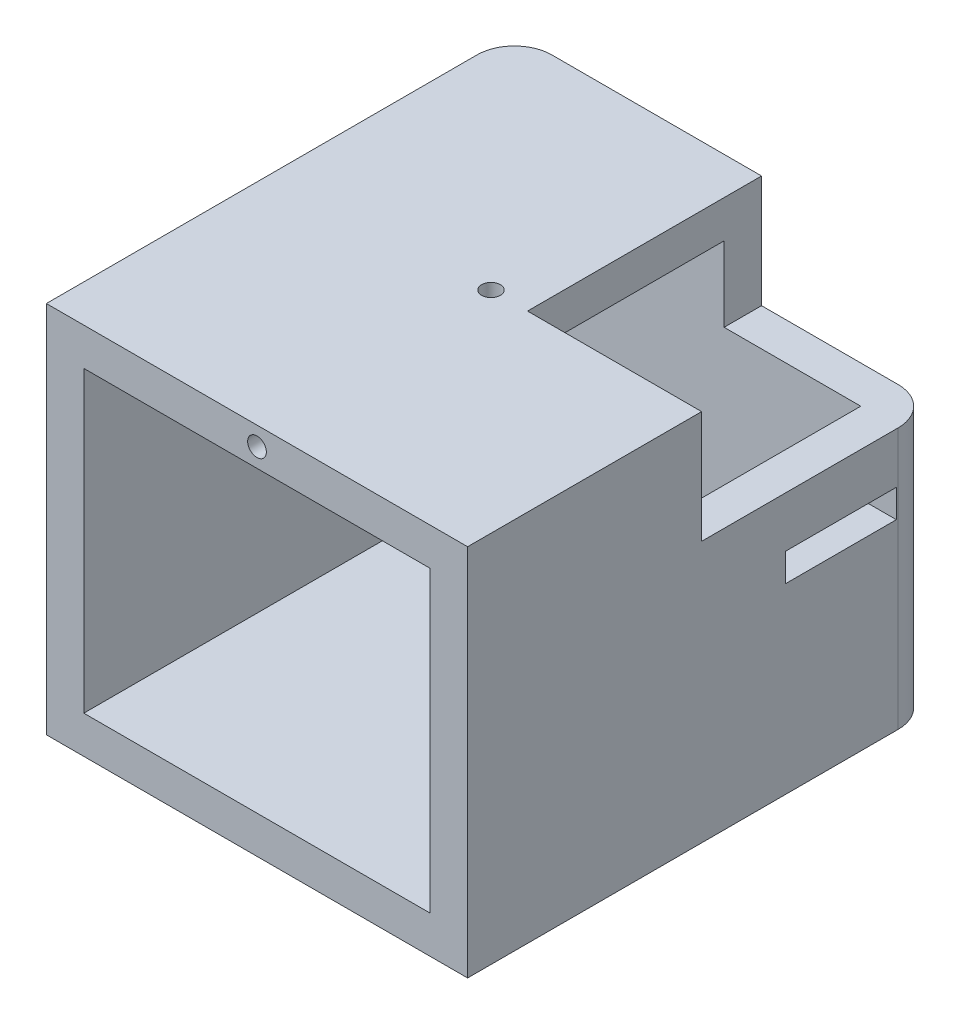
ISO-10303-21;
HEADER;
FILE_DESCRIPTION(('STEP AP214'),'2;1');
FILE_NAME('part.step','',(''),(''),'','','');
FILE_SCHEMA(('AUTOMOTIVE_DESIGN { 1 0 10303 214 1 1 1 1 }'));
ENDSEC;
DATA;
#1=APPLICATION_CONTEXT('core data for automotive mechanical design processes');
#2=APPLICATION_PROTOCOL_DEFINITION('international standard','automotive_design',2000,#1);
#3=PRODUCT_CONTEXT('',#1,'mechanical');
#4=PRODUCT('Part','Part','',(#3));
#5=PRODUCT_RELATED_PRODUCT_CATEGORY('part','',(#4));
#6=PRODUCT_DEFINITION_FORMATION('','',#4);
#7=PRODUCT_DEFINITION_CONTEXT('part definition',#1,'design');
#8=PRODUCT_DEFINITION('design','',#6,#7);
#9=PRODUCT_DEFINITION_SHAPE('','',#8);
#10=(LENGTH_UNIT() NAMED_UNIT(*) SI_UNIT(.MILLI.,.METRE.));
#11=(NAMED_UNIT(*) PLANE_ANGLE_UNIT() SI_UNIT($,.RADIAN.));
#12=(NAMED_UNIT(*) SI_UNIT($,.STERADIAN.) SOLID_ANGLE_UNIT());
#13=UNCERTAINTY_MEASURE_WITH_UNIT(LENGTH_MEASURE(1.E-05),#10,'distance_accuracy_value','');
#14=(GEOMETRIC_REPRESENTATION_CONTEXT(3) GLOBAL_UNCERTAINTY_ASSIGNED_CONTEXT((#13)) GLOBAL_UNIT_ASSIGNED_CONTEXT((#10,
#11,#12)) REPRESENTATION_CONTEXT('',''));
#15=CARTESIAN_POINT('',(0.,0.,0.));
#16=DIRECTION('',(0.,0.,1.));
#17=DIRECTION('',(1.,0.,0.));
#18=AXIS2_PLACEMENT_3D('',#15,#16,#17);
#19=CARTESIAN_POINT('',(22.5,19.95,-25.));
#20=DIRECTION('',(0.,0.,1.));
#21=DIRECTION('',(0.,-1.,0.));
#22=AXIS2_PLACEMENT_3D('',#19,#20,#21);
#23=PLANE('',#22);
#24=DIRECTION('',(-1.,0.,0.));
#25=VECTOR('',#24,1.);
#26=CARTESIAN_POINT('',(22.5,7.95,-25.));
#27=LINE('',#26,#25);
#28=CARTESIAN_POINT('',(18.5,7.95,-25.));
#29=VERTEX_POINT('',#28);
#30=CARTESIAN_POINT('',(3.9,7.95,-25.));
#31=VERTEX_POINT('',#30);
#32=EDGE_CURVE('E329',#29,#31,#27,.T.);
#33=ORIENTED_EDGE('',*,*,#32,.F.);
#34=DIRECTION('',(0.,1.,0.));
#35=VECTOR('',#34,1.);
#36=CARTESIAN_POINT('',(18.5,19.95,-25.));
#37=LINE('',#36,#35);
#38=CARTESIAN_POINT('',(18.5,-19.95,-25.));
#39=VERTEX_POINT('',#38);
#40=EDGE_CURVE('E547',#29,#39,#37,.F.);
#41=ORIENTED_EDGE('',*,*,#40,.T.);
#42=DIRECTION('',(-1.,0.,0.));
#43=VECTOR('',#42,1.);
#44=CARTESIAN_POINT('',(22.5,-19.95,-25.));
#45=LINE('',#44,#43);
#46=CARTESIAN_POINT('',(-18.5,-19.95,-25.));
#47=VERTEX_POINT('',#46);
#48=EDGE_CURVE('E491',#39,#47,#45,.T.);
#49=ORIENTED_EDGE('',*,*,#48,.T.);
#50=DIRECTION('',(0.,1.,0.));
#51=VECTOR('',#50,1.);
#52=CARTESIAN_POINT('',(-18.5,10.75,-25.));
#53=LINE('',#52,#51);
#54=CARTESIAN_POINT('',(-18.5,10.75,-25.));
#55=VERTEX_POINT('',#54);
#56=EDGE_CURVE('E543',#47,#55,#53,.T.);
#57=ORIENTED_EDGE('',*,*,#56,.T.);
#58=DIRECTION('',(-1.,0.,0.));
#59=VECTOR('',#58,1.);
#60=CARTESIAN_POINT('',(-22.5,10.75,-25.));
#61=LINE('',#60,#59);
#62=CARTESIAN_POINT('',(-5.9,10.75,-25.));
#63=VERTEX_POINT('',#62);
#64=EDGE_CURVE('E379',#63,#55,#61,.T.);
#65=ORIENTED_EDGE('',*,*,#64,.F.);
#66=DIRECTION('',(0.,-1.,0.));
#67=VECTOR('',#66,1.);
#68=CARTESIAN_POINT('',(-5.9,14.25,-25.));
#69=LINE('',#68,#67);
#70=CARTESIAN_POINT('',(-5.9,14.25,-25.));
#71=VERTEX_POINT('',#70);
#72=EDGE_CURVE('E397',#71,#63,#69,.T.);
#73=ORIENTED_EDGE('',*,*,#72,.F.);
#74=DIRECTION('',(-1.,0.,0.));
#75=VECTOR('',#74,1.);
#76=CARTESIAN_POINT('',(-22.5,14.25,-25.));
#77=LINE('',#76,#75);
#78=CARTESIAN_POINT('',(-18.5,14.25,-25.));
#79=VERTEX_POINT('',#78);
#80=EDGE_CURVE('E393',#71,#79,#77,.T.);
#81=ORIENTED_EDGE('',*,*,#80,.T.);
#82=DIRECTION('',(0.,1.,0.));
#83=VECTOR('',#82,1.);
#84=CARTESIAN_POINT('',(-18.5,19.95,-25.));
#85=LINE('',#84,#83);
#86=CARTESIAN_POINT('',(-18.5,19.95,-25.));
#87=VERTEX_POINT('',#86);
#88=EDGE_CURVE('E539',#79,#87,#85,.T.);
#89=ORIENTED_EDGE('',*,*,#88,.T.);
#90=DIRECTION('',(-1.,0.,0.));
#91=VECTOR('',#90,1.);
#92=CARTESIAN_POINT('',(22.5,19.95,-25.));
#93=LINE('',#92,#91);
#94=CARTESIAN_POINT('',(3.9,19.95,-25.));
#95=VERTEX_POINT('',#94);
#96=EDGE_CURVE('E511',#95,#87,#93,.T.);
#97=ORIENTED_EDGE('',*,*,#96,.F.);
#98=DIRECTION('',(0.,1.,0.));
#99=VECTOR('',#98,1.);
#100=CARTESIAN_POINT('',(3.9,7.95,-25.));
#101=LINE('',#100,#99);
#102=EDGE_CURVE('E336',#31,#95,#101,.T.);
#103=ORIENTED_EDGE('',*,*,#102,.F.);
#104=EDGE_LOOP('',(#33,#41,#49,#57,#65,#73,#81,#89,#97,#103));
#105=FACE_BOUND('',#104,.T.);
#106=ADVANCED_FACE('F46',(#105),#23,.F.);
#107=CARTESIAN_POINT('',(-22.5,0.,0.));
#108=DIRECTION('',(-1.,0.,0.));
#109=DIRECTION('',(0.,0.,1.));
#110=AXIS2_PLACEMENT_3D('',#107,#108,#109);
#111=PLANE('',#110);
#112=DIRECTION('',(0.,-1.,0.));
#113=VECTOR('',#112,1.);
#114=CARTESIAN_POINT('',(-22.5,0.,-20.8));
#115=LINE('',#114,#113);
#116=CARTESIAN_POINT('',(-22.5,2.55,-20.8));
#117=VERTEX_POINT('',#116);
#118=CARTESIAN_POINT('',(-22.5,-0.449999999999999,-20.8));
#119=VERTEX_POINT('',#118);
#120=EDGE_CURVE('E315',#117,#119,#115,.T.);
#121=ORIENTED_EDGE('',*,*,#120,.F.);
#122=DIRECTION('',(0.,0.,-1.));
#123=VECTOR('',#122,1.);
#124=CARTESIAN_POINT('',(-22.5,2.55,0.));
#125=LINE('',#124,#123);
#126=CARTESIAN_POINT('',(-22.5,2.55,-8.95));
#127=VERTEX_POINT('',#126);
#128=EDGE_CURVE('E308',#127,#117,#125,.T.);
#129=ORIENTED_EDGE('',*,*,#128,.F.);
#130=DIRECTION('',(0.,1.,0.));
#131=VECTOR('',#130,1.);
#132=CARTESIAN_POINT('',(-22.5,0.,-8.95));
#133=LINE('',#132,#131);
#134=CARTESIAN_POINT('',(-22.5,-0.449999999999999,-8.95));
#135=VERTEX_POINT('',#134);
#136=EDGE_CURVE('E301',#135,#127,#133,.T.);
#137=ORIENTED_EDGE('',*,*,#136,.F.);
#138=DIRECTION('',(0.,0.,1.));
#139=VECTOR('',#138,1.);
#140=CARTESIAN_POINT('',(-22.5,-0.449999999999999,0.));
#141=LINE('',#140,#139);
#142=EDGE_CURVE('E294',#119,#135,#141,.T.);
#143=ORIENTED_EDGE('',*,*,#142,.F.);
#144=EDGE_LOOP('',(#121,#129,#137,#143));
#145=FACE_BOUND('',#144,.T.);
#146=DIRECTION('',(0.,0.,1.));
#147=VECTOR('',#146,1.);
#148=CARTESIAN_POINT('',(-22.5,10.75,0.));
#149=LINE('',#148,#147);
#150=CARTESIAN_POINT('',(-22.5,10.75,-21.));
#151=VERTEX_POINT('',#150);
#152=CARTESIAN_POINT('',(-22.5,10.75,0.));
#153=VERTEX_POINT('',#152);
#154=EDGE_CURVE('E398',#151,#153,#149,.T.);
#155=ORIENTED_EDGE('',*,*,#154,.F.);
#156=DIRECTION('',(0.,1.,0.));
#157=VECTOR('',#156,1.);
#158=CARTESIAN_POINT('',(-22.5,-19.95,-21.));
#159=LINE('',#158,#157);
#160=CARTESIAN_POINT('',(-22.5,-19.95,-21.));
#161=VERTEX_POINT('',#160);
#162=EDGE_CURVE('E561',#151,#161,#159,.F.);
#163=ORIENTED_EDGE('',*,*,#162,.T.);
#164=DIRECTION('',(0.,0.,-1.));
#165=VECTOR('',#164,1.);
#166=CARTESIAN_POINT('',(-22.5,-19.95,-25.));
#167=LINE('',#166,#165);
#168=CARTESIAN_POINT('',(-22.5,-19.95,25.));
#169=VERTEX_POINT('',#168);
#170=EDGE_CURVE('E484',#169,#161,#167,.T.);
#171=ORIENTED_EDGE('',*,*,#170,.F.);
#172=DIRECTION('',(0.,-1.,0.));
#173=VECTOR('',#172,1.);
#174=CARTESIAN_POINT('',(-22.5,19.95,25.));
#175=LINE('',#174,#173);
#176=CARTESIAN_POINT('',(-22.5,19.95,25.));
#177=VERTEX_POINT('',#176);
#178=EDGE_CURVE('E494',#177,#169,#175,.T.);
#179=ORIENTED_EDGE('',*,*,#178,.F.);
#180=DIRECTION('',(0.,0.,1.));
#181=VECTOR('',#180,1.);
#182=CARTESIAN_POINT('',(-22.5,19.95,-25.));
#183=LINE('',#182,#181);
#184=CARTESIAN_POINT('',(-22.5,19.95,-21.));
#185=VERTEX_POINT('',#184);
#186=EDGE_CURVE('E445',#185,#177,#183,.T.);
#187=ORIENTED_EDGE('',*,*,#186,.F.);
#188=DIRECTION('',(0.,1.,0.));
#189=VECTOR('',#188,1.);
#190=CARTESIAN_POINT('',(-22.5,14.25,-21.));
#191=LINE('',#190,#189);
#192=CARTESIAN_POINT('',(-22.5,14.25,-21.));
#193=VERTEX_POINT('',#192);
#194=EDGE_CURVE('E68',#185,#193,#191,.F.);
#195=ORIENTED_EDGE('',*,*,#194,.T.);
#196=DIRECTION('',(0.,0.,1.));
#197=VECTOR('',#196,1.);
#198=CARTESIAN_POINT('',(-22.5,14.25,0.));
#199=LINE('',#198,#197);
#200=CARTESIAN_POINT('',(-22.5,14.25,0.));
#201=VERTEX_POINT('',#200);
#202=EDGE_CURVE('E375',#193,#201,#199,.T.);
#203=ORIENTED_EDGE('',*,*,#202,.T.);
#204=DIRECTION('',(0.,-1.,0.));
#205=VECTOR('',#204,1.);
#206=CARTESIAN_POINT('',(-22.5,14.25,0.));
#207=LINE('',#206,#205);
#208=EDGE_CURVE('E428',#201,#153,#207,.T.);
#209=ORIENTED_EDGE('',*,*,#208,.T.);
#210=EDGE_LOOP('',(#155,#163,#171,#179,#187,#195,#203,#209));
#211=FACE_BOUND('',#210,.T.);
#212=ADVANCED_FACE('F584',(#145,#211),#111,.T.);
#213=CARTESIAN_POINT('',(22.5,19.95,-21.));
#214=DIRECTION('',(0.,0.,1.));
#215=DIRECTION('',(0.,-1.,0.));
#216=AXIS2_PLACEMENT_3D('',#213,#214,#215);
#217=PLANE('',#216);
#218=DIRECTION('',(0.,-1.,0.));
#219=VECTOR('',#218,1.);
#220=CARTESIAN_POINT('',(3.9,19.95,-21.));
#221=LINE('',#220,#219);
#222=CARTESIAN_POINT('',(3.9,15.95,-21.));
#223=VERTEX_POINT('',#222);
#224=CARTESIAN_POINT('',(3.9,7.95,-21.));
#225=VERTEX_POINT('',#224);
#226=EDGE_CURVE('E355',#223,#225,#221,.T.);
#227=ORIENTED_EDGE('',*,*,#226,.F.);
#228=DIRECTION('',(-1.,0.,0.));
#229=VECTOR('',#228,1.);
#230=CARTESIAN_POINT('',(22.5,15.95,-21.));
#231=LINE('',#230,#229);
#232=CARTESIAN_POINT('',(-18.5,15.95,-21.));
#233=VERTEX_POINT('',#232);
#234=EDGE_CURVE('E442',#223,#233,#231,.T.);
#235=ORIENTED_EDGE('',*,*,#234,.T.);
#236=DIRECTION('',(0.,1.,0.));
#237=VECTOR('',#236,1.);
#238=CARTESIAN_POINT('',(-18.5,0.,-21.));
#239=LINE('',#238,#237);
#240=CARTESIAN_POINT('',(-18.5,14.25,-21.));
#241=VERTEX_POINT('',#240);
#242=EDGE_CURVE('E432',#241,#233,#239,.T.);
#243=ORIENTED_EDGE('',*,*,#242,.F.);
#244=DIRECTION('',(1.,0.,0.));
#245=VECTOR('',#244,1.);
#246=CARTESIAN_POINT('',(-5.9,14.25,-21.));
#247=LINE('',#246,#245);
#248=CARTESIAN_POINT('',(-5.9,14.25,-21.));
#249=VERTEX_POINT('',#248);
#250=EDGE_CURVE('E386',#241,#249,#247,.T.);
#251=ORIENTED_EDGE('',*,*,#250,.T.);
#252=DIRECTION('',(0.,-1.,0.));
#253=VECTOR('',#252,1.);
#254=CARTESIAN_POINT('',(-5.9,14.25,-21.));
#255=LINE('',#254,#253);
#256=CARTESIAN_POINT('',(-5.9,10.75,-21.));
#257=VERTEX_POINT('',#256);
#258=EDGE_CURVE('E421',#249,#257,#255,.T.);
#259=ORIENTED_EDGE('',*,*,#258,.T.);
#260=DIRECTION('',(1.,0.,0.));
#261=VECTOR('',#260,1.);
#262=CARTESIAN_POINT('',(-5.9,10.75,-21.));
#263=LINE('',#262,#261);
#264=CARTESIAN_POINT('',(-18.5,10.75,-21.));
#265=VERTEX_POINT('',#264);
#266=EDGE_CURVE('E409',#265,#257,#263,.T.);
#267=ORIENTED_EDGE('',*,*,#266,.F.);
#268=CARTESIAN_POINT('',(-18.5,-15.95,-21.));
#269=VERTEX_POINT('',#268);
#270=EDGE_CURVE('E437',#269,#265,#239,.T.);
#271=ORIENTED_EDGE('',*,*,#270,.F.);
#272=DIRECTION('',(-1.,0.,0.));
#273=VECTOR('',#272,1.);
#274=CARTESIAN_POINT('',(22.5,-15.95,-21.));
#275=LINE('',#274,#273);
#276=CARTESIAN_POINT('',(18.5,-15.95,-21.));
#277=VERTEX_POINT('',#276);
#278=EDGE_CURVE('E453',#277,#269,#275,.T.);
#279=ORIENTED_EDGE('',*,*,#278,.F.);
#280=DIRECTION('',(0.,1.,0.));
#281=VECTOR('',#280,1.);
#282=CARTESIAN_POINT('',(18.5,0.,-21.));
#283=LINE('',#282,#281);
#284=CARTESIAN_POINT('',(18.5,7.95,-21.));
#285=VERTEX_POINT('',#284);
#286=EDGE_CURVE('E447',#277,#285,#283,.T.);
#287=ORIENTED_EDGE('',*,*,#286,.T.);
#288=DIRECTION('',(-1.,0.,0.));
#289=VECTOR('',#288,1.);
#290=CARTESIAN_POINT('',(22.5,7.95,-21.));
#291=LINE('',#290,#289);
#292=EDGE_CURVE('E351',#285,#225,#291,.T.);
#293=ORIENTED_EDGE('',*,*,#292,.T.);
#294=EDGE_LOOP('',(#227,#235,#243,#251,#259,#267,#271,#279,#287,#293));
#295=FACE_BOUND('',#294,.T.);
#296=ADVANCED_FACE('F596',(#295),#217,.T.);
#297=CARTESIAN_POINT('',(-18.5,0.,0.));
#298=DIRECTION('',(-1.,0.,0.));
#299=DIRECTION('',(0.,0.,1.));
#300=AXIS2_PLACEMENT_3D('',#297,#298,#299);
#301=PLANE('',#300);
#302=DIRECTION('',(0.,0.,-1.));
#303=VECTOR('',#302,1.);
#304=CARTESIAN_POINT('',(-18.5,2.55,0.));
#305=LINE('',#304,#303);
#306=CARTESIAN_POINT('',(-18.5,2.55,-8.95));
#307=VERTEX_POINT('',#306);
#308=CARTESIAN_POINT('',(-18.5,2.55,-20.8));
#309=VERTEX_POINT('',#308);
#310=EDGE_CURVE('E304',#307,#309,#305,.T.);
#311=ORIENTED_EDGE('',*,*,#310,.T.);
#312=DIRECTION('',(0.,-1.,0.));
#313=VECTOR('',#312,1.);
#314=CARTESIAN_POINT('',(-18.5,0.,-20.8));
#315=LINE('',#314,#313);
#316=CARTESIAN_POINT('',(-18.5,-0.449999999999999,-20.8));
#317=VERTEX_POINT('',#316);
#318=EDGE_CURVE('E311',#309,#317,#315,.T.);
#319=ORIENTED_EDGE('',*,*,#318,.T.);
#320=DIRECTION('',(0.,0.,1.));
#321=VECTOR('',#320,1.);
#322=CARTESIAN_POINT('',(-18.5,-0.449999999999999,0.));
#323=LINE('',#322,#321);
#324=CARTESIAN_POINT('',(-18.5,-0.449999999999999,-8.95));
#325=VERTEX_POINT('',#324);
#326=EDGE_CURVE('E282',#317,#325,#323,.T.);
#327=ORIENTED_EDGE('',*,*,#326,.T.);
#328=DIRECTION('',(0.,1.,0.));
#329=VECTOR('',#328,1.);
#330=CARTESIAN_POINT('',(-18.5,0.,-8.95));
#331=LINE('',#330,#329);
#332=EDGE_CURVE('E297',#325,#307,#331,.T.);
#333=ORIENTED_EDGE('',*,*,#332,.T.);
#334=EDGE_LOOP('',(#311,#319,#327,#333));
#335=FACE_BOUND('',#334,.T.);
#336=DIRECTION('',(0.,0.,-1.));
#337=VECTOR('',#336,1.);
#338=CARTESIAN_POINT('',(-18.5,14.25,-21.));
#339=LINE('',#338,#337);
#340=CARTESIAN_POINT('',(-18.5,14.25,0.));
#341=VERTEX_POINT('',#340);
#342=EDGE_CURVE('E382',#341,#241,#339,.T.);
#343=ORIENTED_EDGE('',*,*,#342,.T.);
#344=ORIENTED_EDGE('',*,*,#242,.T.);
#345=DIRECTION('',(0.,0.,1.));
#346=VECTOR('',#345,1.);
#347=CARTESIAN_POINT('',(-18.5,15.95,0.));
#348=LINE('',#347,#346);
#349=CARTESIAN_POINT('',(-18.5,15.95,25.));
#350=VERTEX_POINT('',#349);
#351=EDGE_CURVE('E441',#233,#350,#348,.T.);
#352=ORIENTED_EDGE('',*,*,#351,.T.);
#353=DIRECTION('',(0.,-1.,0.));
#354=VECTOR('',#353,1.);
#355=CARTESIAN_POINT('',(-18.5,0.,25.));
#356=LINE('',#355,#354);
#357=CARTESIAN_POINT('',(-18.5,-15.95,25.));
#358=VERTEX_POINT('',#357);
#359=EDGE_CURVE('E461',#350,#358,#356,.T.);
#360=ORIENTED_EDGE('',*,*,#359,.T.);
#361=DIRECTION('',(0.,0.,-1.));
#362=VECTOR('',#361,1.);
#363=CARTESIAN_POINT('',(-18.5,-15.95,0.));
#364=LINE('',#363,#362);
#365=EDGE_CURVE('E452',#358,#269,#364,.T.);
#366=ORIENTED_EDGE('',*,*,#365,.T.);
#367=ORIENTED_EDGE('',*,*,#270,.T.);
#368=DIRECTION('',(0.,0.,-1.));
#369=VECTOR('',#368,1.);
#370=CARTESIAN_POINT('',(-18.5,10.75,-21.));
#371=LINE('',#370,#369);
#372=CARTESIAN_POINT('',(-18.5,10.75,0.));
#373=VERTEX_POINT('',#372);
#374=EDGE_CURVE('E406',#373,#265,#371,.T.);
#375=ORIENTED_EDGE('',*,*,#374,.F.);
#376=DIRECTION('',(0.,-1.,0.));
#377=VECTOR('',#376,1.);
#378=CARTESIAN_POINT('',(-18.5,14.25,0.));
#379=LINE('',#378,#377);
#380=EDGE_CURVE('E425',#341,#373,#379,.T.);
#381=ORIENTED_EDGE('',*,*,#380,.F.);
#382=EDGE_LOOP('',(#343,#344,#352,#360,#366,#367,#375,#381));
#383=FACE_BOUND('',#382,.T.);
#384=ADVANCED_FACE('F592',(#335,#383),#301,.F.);
#385=CARTESIAN_POINT('',(22.5,19.95,25.));
#386=DIRECTION('',(0.,0.,-1.));
#387=DIRECTION('',(0.,1.,0.));
#388=AXIS2_PLACEMENT_3D('',#385,#386,#387);
#389=PLANE('',#388);
#390=CARTESIAN_POINT('',(0.,17.95,25.));
#391=DIRECTION('',(0.,0.,1.));
#392=DIRECTION('',(1.,0.,0.));
#393=AXIS2_PLACEMENT_3D('',#390,#391,#392);
#394=CIRCLE('',#393,1.);
#395=CARTESIAN_POINT('',(1.,17.95,25.));
#396=VERTEX_POINT('',#395);
#397=EDGE_CURVE('E358',#396,#396,#394,.T.);
#398=ORIENTED_EDGE('',*,*,#397,.F.);
#399=EDGE_LOOP('',(#398));
#400=FACE_BOUND('',#399,.T.);
#401=ORIENTED_EDGE('',*,*,#178,.T.);
#402=DIRECTION('',(-1.,0.,0.));
#403=VECTOR('',#402,1.);
#404=CARTESIAN_POINT('',(22.5,-19.95,25.));
#405=LINE('',#404,#403);
#406=CARTESIAN_POINT('',(22.5,-19.95,25.));
#407=VERTEX_POINT('',#406);
#408=EDGE_CURVE('E503',#407,#169,#405,.T.);
#409=ORIENTED_EDGE('',*,*,#408,.F.);
#410=DIRECTION('',(0.,-1.,0.));
#411=VECTOR('',#410,1.);
#412=CARTESIAN_POINT('',(22.5,19.95,25.));
#413=LINE('',#412,#411);
#414=CARTESIAN_POINT('',(22.5,19.95,25.));
#415=VERTEX_POINT('',#414);
#416=EDGE_CURVE('E483',#415,#407,#413,.T.);
#417=ORIENTED_EDGE('',*,*,#416,.F.);
#418=DIRECTION('',(-1.,0.,0.));
#419=VECTOR('',#418,1.);
#420=CARTESIAN_POINT('',(22.5,19.95,25.));
#421=LINE('',#420,#419);
#422=EDGE_CURVE('E507',#415,#177,#421,.T.);
#423=ORIENTED_EDGE('',*,*,#422,.T.);
#424=EDGE_LOOP('',(#401,#409,#417,#423));
#425=FACE_BOUND('',#424,.T.);
#426=ORIENTED_EDGE('',*,*,#359,.F.);
#427=DIRECTION('',(-1.,0.,0.));
#428=VECTOR('',#427,1.);
#429=CARTESIAN_POINT('',(22.5,15.95,25.));
#430=LINE('',#429,#428);
#431=CARTESIAN_POINT('',(18.5,15.95,25.));
#432=VERTEX_POINT('',#431);
#433=EDGE_CURVE('E446',#432,#350,#430,.T.);
#434=ORIENTED_EDGE('',*,*,#433,.F.);
#435=DIRECTION('',(0.,-1.,0.));
#436=VECTOR('',#435,1.);
#437=CARTESIAN_POINT('',(18.5,0.,25.));
#438=LINE('',#437,#436);
#439=CARTESIAN_POINT('',(18.5,-15.95,25.));
#440=VERTEX_POINT('',#439);
#441=EDGE_CURVE('E464',#432,#440,#438,.T.);
#442=ORIENTED_EDGE('',*,*,#441,.T.);
#443=DIRECTION('',(-1.,0.,0.));
#444=VECTOR('',#443,1.);
#445=CARTESIAN_POINT('',(22.5,-15.95,25.));
#446=LINE('',#445,#444);
#447=EDGE_CURVE('E457',#440,#358,#446,.T.);
#448=ORIENTED_EDGE('',*,*,#447,.T.);
#449=EDGE_LOOP('',(#426,#434,#442,#448));
#450=FACE_BOUND('',#449,.T.);
#451=ADVANCED_FACE('F595',(#400,#425,#450),#389,.F.);
#452=CARTESIAN_POINT('',(22.5,19.95,-25.));
#453=DIRECTION('',(0.,-1.,0.));
#454=DIRECTION('',(0.,0.,-1.));
#455=AXIS2_PLACEMENT_3D('',#452,#453,#454);
#456=PLANE('',#455);
#457=CARTESIAN_POINT('',(0.,19.95,0.));
#458=DIRECTION('',(0.,-1.,0.));
#459=DIRECTION('',(0.,0.,-1.));
#460=AXIS2_PLACEMENT_3D('',#457,#458,#459);
#461=CIRCLE('',#460,1.);
#462=CARTESIAN_POINT('',(0.,19.95,-1.));
#463=VERTEX_POINT('',#462);
#464=EDGE_CURVE('E370',#463,#463,#461,.F.);
#465=ORIENTED_EDGE('',*,*,#464,.F.);
#466=EDGE_LOOP('',(#465));
#467=FACE_BOUND('',#466,.T.);
#468=ORIENTED_EDGE('',*,*,#96,.T.);
#469=CARTESIAN_POINT('',(-18.5,19.95,-21.));
#470=DIRECTION('',(0.,-1.,0.));
#471=DIRECTION('',(0.,0.,-1.));
#472=AXIS2_PLACEMENT_3D('',#469,#470,#471);
#473=CIRCLE('',#472,4.);
#474=EDGE_CURVE('E55',#87,#185,#473,.F.);
#475=ORIENTED_EDGE('',*,*,#474,.T.);
#476=ORIENTED_EDGE('',*,*,#186,.T.);
#477=ORIENTED_EDGE('',*,*,#422,.F.);
#478=DIRECTION('',(0.,0.,1.));
#479=VECTOR('',#478,1.);
#480=CARTESIAN_POINT('',(22.5,19.95,-25.));
#481=LINE('',#480,#479);
#482=CARTESIAN_POINT('',(22.5,19.95,0.));
#483=VERTEX_POINT('',#482);
#484=EDGE_CURVE('E480',#483,#415,#481,.T.);
#485=ORIENTED_EDGE('',*,*,#484,.F.);
#486=DIRECTION('',(1.,0.,0.));
#487=VECTOR('',#486,1.);
#488=CARTESIAN_POINT('',(5.9,19.95,0.));
#489=LINE('',#488,#487);
#490=CARTESIAN_POINT('',(3.90000000000001,19.95,0.));
#491=VERTEX_POINT('',#490);
#492=EDGE_CURVE('E325',#491,#483,#489,.T.);
#493=ORIENTED_EDGE('',*,*,#492,.F.);
#494=DIRECTION('',(0.,0.,1.));
#495=VECTOR('',#494,1.);
#496=CARTESIAN_POINT('',(3.9,19.95,-25.));
#497=LINE('',#496,#495);
#498=EDGE_CURVE('E319',#95,#491,#497,.T.);
#499=ORIENTED_EDGE('',*,*,#498,.F.);
#500=EDGE_LOOP('',(#468,#475,#476,#477,#485,#493,#499));
#501=FACE_BOUND('',#500,.T.);
#502=ADVANCED_FACE('F663',(#467,#501),#456,.F.);
#503=CARTESIAN_POINT('',(22.5,-19.95,-25.));
#504=DIRECTION('',(0.,1.,0.));
#505=DIRECTION('',(0.,0.,1.));
#506=AXIS2_PLACEMENT_3D('',#503,#504,#505);
#507=PLANE('',#506);
#508=ORIENTED_EDGE('',*,*,#48,.F.);
#509=CARTESIAN_POINT('',(18.5,-19.95,-21.));
#510=DIRECTION('',(0.,1.,0.));
#511=DIRECTION('',(0.,0.,1.));
#512=AXIS2_PLACEMENT_3D('',#509,#510,#511);
#513=CIRCLE('',#512,4.);
#514=CARTESIAN_POINT('',(22.5,-19.95,-21.));
#515=VERTEX_POINT('',#514);
#516=EDGE_CURVE('E553',#39,#515,#513,.F.);
#517=ORIENTED_EDGE('',*,*,#516,.T.);
#518=DIRECTION('',(0.,0.,-1.));
#519=VECTOR('',#518,1.);
#520=CARTESIAN_POINT('',(22.5,-19.95,-25.));
#521=LINE('',#520,#519);
#522=EDGE_CURVE('E487',#407,#515,#521,.T.);
#523=ORIENTED_EDGE('',*,*,#522,.F.);
#524=ORIENTED_EDGE('',*,*,#408,.T.);
#525=ORIENTED_EDGE('',*,*,#170,.T.);
#526=CARTESIAN_POINT('',(-18.5,-19.95,-21.));
#527=DIRECTION('',(0.,1.,0.));
#528=DIRECTION('',(0.,0.,1.));
#529=AXIS2_PLACEMENT_3D('',#526,#527,#528);
#530=CIRCLE('',#529,4.);
#531=EDGE_CURVE('E550',#161,#47,#530,.F.);
#532=ORIENTED_EDGE('',*,*,#531,.T.);
#533=EDGE_LOOP('',(#508,#517,#523,#524,#525,#532));
#534=FACE_BOUND('',#533,.T.);
#535=ADVANCED_FACE('F679',(#534),#507,.F.);
#536=CARTESIAN_POINT('',(22.5,0.,0.));
#537=DIRECTION('',(-1.,0.,0.));
#538=DIRECTION('',(0.,0.,1.));
#539=AXIS2_PLACEMENT_3D('',#536,#537,#538);
#540=PLANE('',#539);
#541=DIRECTION('',(0.,0.,-1.));
#542=VECTOR('',#541,1.);
#543=CARTESIAN_POINT('',(22.5,2.55,-20.8));
#544=LINE('',#543,#542);
#545=CARTESIAN_POINT('',(22.5,2.55,-8.95));
#546=VERTEX_POINT('',#545);
#547=CARTESIAN_POINT('',(22.5,2.55,-20.8));
#548=VERTEX_POINT('',#547);
#549=EDGE_CURVE('E271',#546,#548,#544,.T.);
#550=ORIENTED_EDGE('',*,*,#549,.T.);
#551=DIRECTION('',(0.,-1.,0.));
#552=VECTOR('',#551,1.);
#553=CARTESIAN_POINT('',(22.5,2.55,-20.8));
#554=LINE('',#553,#552);
#555=CARTESIAN_POINT('',(22.5,-0.449999999999999,-20.8));
#556=VERTEX_POINT('',#555);
#557=EDGE_CURVE('E247',#548,#556,#554,.T.);
#558=ORIENTED_EDGE('',*,*,#557,.T.);
#559=DIRECTION('',(0.,0.,1.));
#560=VECTOR('',#559,1.);
#561=CARTESIAN_POINT('',(22.5,-0.449999999999999,-20.8));
#562=LINE('',#561,#560);
#563=CARTESIAN_POINT('',(22.5,-0.449999999999999,-8.95));
#564=VERTEX_POINT('',#563);
#565=EDGE_CURVE('E259',#556,#564,#562,.T.);
#566=ORIENTED_EDGE('',*,*,#565,.T.);
#567=DIRECTION('',(0.,1.,0.));
#568=VECTOR('',#567,1.);
#569=CARTESIAN_POINT('',(22.5,2.55,-8.95));
#570=LINE('',#569,#568);
#571=EDGE_CURVE('E266',#564,#546,#570,.T.);
#572=ORIENTED_EDGE('',*,*,#571,.T.);
#573=EDGE_LOOP('',(#550,#558,#566,#572));
#574=FACE_BOUND('',#573,.T.);
#575=ORIENTED_EDGE('',*,*,#522,.T.);
#576=DIRECTION('',(0.,1.,0.));
#577=VECTOR('',#576,1.);
#578=CARTESIAN_POINT('',(22.5,0.,-21.));
#579=LINE('',#578,#577);
#580=CARTESIAN_POINT('',(22.5,7.95,-21.));
#581=VERTEX_POINT('',#580);
#582=EDGE_CURVE('E532',#515,#581,#579,.T.);
#583=ORIENTED_EDGE('',*,*,#582,.T.);
#584=DIRECTION('',(0.,0.,-1.));
#585=VECTOR('',#584,1.);
#586=CARTESIAN_POINT('',(22.5,7.95,0.));
#587=LINE('',#586,#585);
#588=CARTESIAN_POINT('',(22.5,7.95,0.));
#589=VERTEX_POINT('',#588);
#590=EDGE_CURVE('E324',#589,#581,#587,.T.);
#591=ORIENTED_EDGE('',*,*,#590,.F.);
#592=DIRECTION('',(0.,-1.,0.));
#593=VECTOR('',#592,1.);
#594=CARTESIAN_POINT('',(22.5,14.25,0.));
#595=LINE('',#594,#593);
#596=EDGE_CURVE('E402',#483,#589,#595,.T.);
#597=ORIENTED_EDGE('',*,*,#596,.F.);
#598=ORIENTED_EDGE('',*,*,#484,.T.);
#599=ORIENTED_EDGE('',*,*,#416,.T.);
#600=EDGE_LOOP('',(#575,#583,#591,#597,#598,#599));
#601=FACE_BOUND('',#600,.T.);
#602=ADVANCED_FACE('F268',(#574,#601),#540,.F.);
#603=CARTESIAN_POINT('',(22.5,15.95,-25.));
#604=DIRECTION('',(0.,-1.,0.));
#605=DIRECTION('',(0.,0.,-1.));
#606=AXIS2_PLACEMENT_3D('',#603,#604,#605);
#607=PLANE('',#606);
#608=DIRECTION('',(-1.,0.,0.));
#609=VECTOR('',#608,1.);
#610=CARTESIAN_POINT('',(22.5,15.95,0.));
#611=LINE('',#610,#609);
#612=CARTESIAN_POINT('',(18.5,15.95,0.));
#613=VERTEX_POINT('',#612);
#614=CARTESIAN_POINT('',(3.90000000000001,15.95,0.));
#615=VERTEX_POINT('',#614);
#616=EDGE_CURVE('E346',#613,#615,#611,.T.);
#617=ORIENTED_EDGE('',*,*,#616,.F.);
#618=DIRECTION('',(0.,0.,1.));
#619=VECTOR('',#618,1.);
#620=CARTESIAN_POINT('',(18.5,15.95,0.));
#621=LINE('',#620,#619);
#622=EDGE_CURVE('E451',#613,#432,#621,.T.);
#623=ORIENTED_EDGE('',*,*,#622,.T.);
#624=ORIENTED_EDGE('',*,*,#433,.T.);
#625=ORIENTED_EDGE('',*,*,#351,.F.);
#626=ORIENTED_EDGE('',*,*,#234,.F.);
#627=DIRECTION('',(0.,0.,-1.));
#628=VECTOR('',#627,1.);
#629=CARTESIAN_POINT('',(3.9,15.95,-25.));
#630=LINE('',#629,#628);
#631=EDGE_CURVE('E518',#615,#223,#630,.T.);
#632=ORIENTED_EDGE('',*,*,#631,.F.);
#633=EDGE_LOOP('',(#617,#623,#624,#625,#626,#632));
#634=FACE_BOUND('',#633,.T.);
#635=CARTESIAN_POINT('',(0.,15.95,0.));
#636=DIRECTION('',(0.,-1.,0.));
#637=DIRECTION('',(0.,0.,-1.));
#638=AXIS2_PLACEMENT_3D('',#635,#636,#637);
#639=CIRCLE('',#638,1.);
#640=CARTESIAN_POINT('',(0.,15.95,-1.));
#641=VERTEX_POINT('',#640);
#642=EDGE_CURVE('E363',#641,#641,#639,.F.);
#643=ORIENTED_EDGE('',*,*,#642,.T.);
#644=EDGE_LOOP('',(#643));
#645=FACE_BOUND('',#644,.T.);
#646=ADVANCED_FACE('F611',(#634,#645),#607,.T.);
#647=CARTESIAN_POINT('',(22.5,-15.95,-25.));
#648=DIRECTION('',(0.,1.,0.));
#649=DIRECTION('',(0.,0.,1.));
#650=AXIS2_PLACEMENT_3D('',#647,#648,#649);
#651=PLANE('',#650);
#652=ORIENTED_EDGE('',*,*,#365,.F.);
#653=ORIENTED_EDGE('',*,*,#447,.F.);
#654=DIRECTION('',(0.,0.,-1.));
#655=VECTOR('',#654,1.);
#656=CARTESIAN_POINT('',(18.5,-15.95,0.));
#657=LINE('',#656,#655);
#658=EDGE_CURVE('E458',#440,#277,#657,.T.);
#659=ORIENTED_EDGE('',*,*,#658,.T.);
#660=ORIENTED_EDGE('',*,*,#278,.T.);
#661=EDGE_LOOP('',(#652,#653,#659,#660));
#662=FACE_BOUND('',#661,.T.);
#663=ADVANCED_FACE('F618',(#662),#651,.T.);
#664=CARTESIAN_POINT('',(18.5,0.,0.));
#665=DIRECTION('',(-1.,0.,0.));
#666=DIRECTION('',(0.,0.,1.));
#667=AXIS2_PLACEMENT_3D('',#664,#665,#666);
#668=PLANE('',#667);
#669=DIRECTION('',(0.,-1.,0.));
#670=VECTOR('',#669,1.);
#671=CARTESIAN_POINT('',(18.5,0.,-20.8));
#672=LINE('',#671,#670);
#673=CARTESIAN_POINT('',(18.5,2.55,-20.8));
#674=VERTEX_POINT('',#673);
#675=CARTESIAN_POINT('',(18.5,-0.449999999999999,-20.8));
#676=VERTEX_POINT('',#675);
#677=EDGE_CURVE('E250',#674,#676,#672,.T.);
#678=ORIENTED_EDGE('',*,*,#677,.F.);
#679=DIRECTION('',(0.,0.,-1.));
#680=VECTOR('',#679,1.);
#681=CARTESIAN_POINT('',(18.5,2.55,0.));
#682=LINE('',#681,#680);
#683=CARTESIAN_POINT('',(18.5,2.55,-8.95));
#684=VERTEX_POINT('',#683);
#685=EDGE_CURVE('E527',#684,#674,#682,.T.);
#686=ORIENTED_EDGE('',*,*,#685,.F.);
#687=DIRECTION('',(0.,1.,0.));
#688=VECTOR('',#687,1.);
#689=CARTESIAN_POINT('',(18.5,0.,-8.95));
#690=LINE('',#689,#688);
#691=CARTESIAN_POINT('',(18.5,-0.449999999999999,-8.95));
#692=VERTEX_POINT('',#691);
#693=EDGE_CURVE('E524',#692,#684,#690,.T.);
#694=ORIENTED_EDGE('',*,*,#693,.F.);
#695=DIRECTION('',(0.,0.,1.));
#696=VECTOR('',#695,1.);
#697=CARTESIAN_POINT('',(18.5,-0.449999999999999,0.));
#698=LINE('',#697,#696);
#699=EDGE_CURVE('E521',#676,#692,#698,.T.);
#700=ORIENTED_EDGE('',*,*,#699,.F.);
#701=EDGE_LOOP('',(#678,#686,#694,#700));
#702=FACE_BOUND('',#701,.T.);
#703=ORIENTED_EDGE('',*,*,#622,.F.);
#704=DIRECTION('',(0.,-1.,0.));
#705=VECTOR('',#704,1.);
#706=CARTESIAN_POINT('',(18.5,14.25,0.));
#707=LINE('',#706,#705);
#708=CARTESIAN_POINT('',(18.5,7.95,0.));
#709=VERTEX_POINT('',#708);
#710=EDGE_CURVE('E374',#613,#709,#707,.T.);
#711=ORIENTED_EDGE('',*,*,#710,.T.);
#712=DIRECTION('',(0.,0.,-1.));
#713=VECTOR('',#712,1.);
#714=CARTESIAN_POINT('',(18.5,7.95,0.));
#715=LINE('',#714,#713);
#716=EDGE_CURVE('E514',#709,#285,#715,.T.);
#717=ORIENTED_EDGE('',*,*,#716,.T.);
#718=ORIENTED_EDGE('',*,*,#286,.F.);
#719=ORIENTED_EDGE('',*,*,#658,.F.);
#720=ORIENTED_EDGE('',*,*,#441,.F.);
#721=EDGE_LOOP('',(#703,#711,#717,#718,#719,#720));
#722=FACE_BOUND('',#721,.T.);
#723=ADVANCED_FACE('F625',(#702,#722),#668,.T.);
#724=CARTESIAN_POINT('',(-18.5,14.25,0.));
#725=DIRECTION('',(0.,0.,-1.));
#726=DIRECTION('',(-1.,0.,0.));
#727=AXIS2_PLACEMENT_3D('',#724,#725,#726);
#728=PLANE('',#727);
#729=DIRECTION('',(1.,0.,0.));
#730=VECTOR('',#729,1.);
#731=CARTESIAN_POINT('',(-18.5,10.75,0.));
#732=LINE('',#731,#730);
#733=EDGE_CURVE('E401',#153,#373,#732,.T.);
#734=ORIENTED_EDGE('',*,*,#733,.F.);
#735=ORIENTED_EDGE('',*,*,#208,.F.);
#736=DIRECTION('',(1.,0.,0.));
#737=VECTOR('',#736,1.);
#738=CARTESIAN_POINT('',(-18.5,14.25,0.));
#739=LINE('',#738,#737);
#740=EDGE_CURVE('E378',#201,#341,#739,.T.);
#741=ORIENTED_EDGE('',*,*,#740,.T.);
#742=ORIENTED_EDGE('',*,*,#380,.T.);
#743=EDGE_LOOP('',(#734,#735,#741,#742));
#744=FACE_BOUND('',#743,.T.);
#745=ADVANCED_FACE('F635',(#744),#728,.T.);
#746=CARTESIAN_POINT('',(-5.9,14.25,-25.));
#747=DIRECTION('',(-1.,0.,0.));
#748=DIRECTION('',(0.,0.,1.));
#749=AXIS2_PLACEMENT_3D('',#746,#747,#748);
#750=PLANE('',#749);
#751=DIRECTION('',(0.,0.,-1.));
#752=VECTOR('',#751,1.);
#753=CARTESIAN_POINT('',(-5.9,10.75,-25.));
#754=LINE('',#753,#752);
#755=EDGE_CURVE('E412',#257,#63,#754,.T.);
#756=ORIENTED_EDGE('',*,*,#755,.F.);
#757=ORIENTED_EDGE('',*,*,#258,.F.);
#758=DIRECTION('',(0.,0.,-1.));
#759=VECTOR('',#758,1.);
#760=CARTESIAN_POINT('',(-5.9,14.25,-25.));
#761=LINE('',#760,#759);
#762=EDGE_CURVE('E390',#249,#71,#761,.T.);
#763=ORIENTED_EDGE('',*,*,#762,.T.);
#764=ORIENTED_EDGE('',*,*,#72,.T.);
#765=EDGE_LOOP('',(#756,#757,#763,#764));
#766=FACE_BOUND('',#765,.T.);
#767=ADVANCED_FACE('F640',(#766),#750,.T.);
#768=CARTESIAN_POINT('',(0.,14.25,0.));
#769=DIRECTION('',(0.,-1.,0.));
#770=DIRECTION('',(0.,0.,-1.));
#771=AXIS2_PLACEMENT_3D('',#768,#769,#770);
#772=PLANE('',#771);
#773=ORIENTED_EDGE('',*,*,#202,.F.);
#774=CARTESIAN_POINT('',(-18.5,14.25,-21.));
#775=DIRECTION('',(0.,-1.,0.));
#776=DIRECTION('',(0.,0.,-1.));
#777=AXIS2_PLACEMENT_3D('',#774,#775,#776);
#778=CIRCLE('',#777,4.);
#779=EDGE_CURVE('E11',#193,#79,#778,.T.);
#780=ORIENTED_EDGE('',*,*,#779,.T.);
#781=ORIENTED_EDGE('',*,*,#80,.F.);
#782=ORIENTED_EDGE('',*,*,#762,.F.);
#783=ORIENTED_EDGE('',*,*,#250,.F.);
#784=ORIENTED_EDGE('',*,*,#342,.F.);
#785=ORIENTED_EDGE('',*,*,#740,.F.);
#786=EDGE_LOOP('',(#773,#780,#781,#782,#783,#784,#785));
#787=FACE_BOUND('',#786,.T.);
#788=ADVANCED_FACE('F638',(#787),#772,.T.);
#789=CARTESIAN_POINT('',(0.,10.75,0.));
#790=DIRECTION('',(0.,-1.,0.));
#791=DIRECTION('',(0.,0.,-1.));
#792=AXIS2_PLACEMENT_3D('',#789,#790,#791);
#793=PLANE('',#792);
#794=ORIENTED_EDGE('',*,*,#64,.T.);
#795=CARTESIAN_POINT('',(-18.5,10.75,-21.));
#796=DIRECTION('',(0.,-1.,0.));
#797=DIRECTION('',(0.,0.,-1.));
#798=AXIS2_PLACEMENT_3D('',#795,#796,#797);
#799=CIRCLE('',#798,4.);
#800=EDGE_CURVE('E556',#55,#151,#799,.F.);
#801=ORIENTED_EDGE('',*,*,#800,.T.);
#802=ORIENTED_EDGE('',*,*,#154,.T.);
#803=ORIENTED_EDGE('',*,*,#733,.T.);
#804=ORIENTED_EDGE('',*,*,#374,.T.);
#805=ORIENTED_EDGE('',*,*,#266,.T.);
#806=ORIENTED_EDGE('',*,*,#755,.T.);
#807=EDGE_LOOP('',(#794,#801,#802,#803,#804,#805,#806));
#808=FACE_BOUND('',#807,.T.);
#809=ADVANCED_FACE('F629',(#808),#793,.F.);
#810=CARTESIAN_POINT('',(18.5,14.25,0.));
#811=DIRECTION('',(0.,0.,-1.));
#812=DIRECTION('',(-1.,0.,0.));
#813=AXIS2_PLACEMENT_3D('',#810,#811,#812);
#814=PLANE('',#813);
#815=ORIENTED_EDGE('',*,*,#596,.T.);
#816=DIRECTION('',(1.,0.,0.));
#817=VECTOR('',#816,1.);
#818=CARTESIAN_POINT('',(18.5,7.95,0.));
#819=LINE('',#818,#817);
#820=EDGE_CURVE('E320',#709,#589,#819,.T.);
#821=ORIENTED_EDGE('',*,*,#820,.F.);
#822=ORIENTED_EDGE('',*,*,#710,.F.);
#823=ORIENTED_EDGE('',*,*,#616,.T.);
#824=DIRECTION('',(0.,1.,0.));
#825=VECTOR('',#824,1.);
#826=CARTESIAN_POINT('',(3.90000000000001,7.95,0.));
#827=LINE('',#826,#825);
#828=EDGE_CURVE('E343',#615,#491,#827,.T.);
#829=ORIENTED_EDGE('',*,*,#828,.T.);
#830=ORIENTED_EDGE('',*,*,#492,.T.);
#831=EDGE_LOOP('',(#815,#821,#822,#823,#829,#830));
#832=FACE_BOUND('',#831,.T.);
#833=ADVANCED_FACE('F646',(#832),#814,.T.);
#834=CARTESIAN_POINT('',(0.,19.950012,0.));
#835=DIRECTION('',(0.,-1.,0.));
#836=DIRECTION('',(0.,0.,-1.));
#837=AXIS2_PLACEMENT_3D('',#834,#835,#836);
#838=CYLINDRICAL_SURFACE('',#837,1.);
#839=ORIENTED_EDGE('',*,*,#642,.F.);
#840=EDGE_LOOP('',(#839));
#841=FACE_BOUND('',#840,.T.);
#842=ORIENTED_EDGE('',*,*,#464,.T.);
#843=EDGE_LOOP('',(#842));
#844=FACE_BOUND('',#843,.T.);
#845=ADVANCED_FACE('F711',(#841,#844),#838,.F.);
#846=CARTESIAN_POINT('',(0.,17.95,20.));
#847=DIRECTION('',(0.,0.,1.));
#848=DIRECTION('',(1.,0.,0.));
#849=AXIS2_PLACEMENT_3D('',#846,#847,#848);
#850=CYLINDRICAL_SURFACE('',#849,1.);
#851=CARTESIAN_POINT('',(0.,17.95,20.));
#852=DIRECTION('',(0.,0.,1.));
#853=DIRECTION('',(1.,0.,0.));
#854=AXIS2_PLACEMENT_3D('',#851,#852,#853);
#855=CIRCLE('',#854,1.);
#856=CARTESIAN_POINT('',(1.,17.95,20.));
#857=VERTEX_POINT('',#856);
#858=EDGE_CURVE('E359',#857,#857,#855,.T.);
#859=ORIENTED_EDGE('',*,*,#858,.F.);
#860=EDGE_LOOP('',(#859));
#861=FACE_BOUND('',#860,.T.);
#862=ORIENTED_EDGE('',*,*,#397,.T.);
#863=EDGE_LOOP('',(#862));
#864=FACE_BOUND('',#863,.T.);
#865=ADVANCED_FACE('F718',(#861,#864),#850,.F.);
#866=CARTESIAN_POINT('',(0.,17.95,20.));
#867=DIRECTION('',(0.,0.,1.));
#868=DIRECTION('',(1.,0.,0.));
#869=AXIS2_PLACEMENT_3D('',#866,#867,#868);
#870=PLANE('',#869);
#871=ORIENTED_EDGE('',*,*,#858,.T.);
#872=EDGE_LOOP('',(#871));
#873=FACE_BOUND('',#872,.T.);
#874=ADVANCED_FACE('F741',(#873),#870,.T.);
#875=CARTESIAN_POINT('',(3.9,7.95,-25.));
#876=DIRECTION('',(-1.,0.,0.));
#877=DIRECTION('',(0.,0.,1.));
#878=AXIS2_PLACEMENT_3D('',#875,#876,#877);
#879=PLANE('',#878);
#880=ORIENTED_EDGE('',*,*,#226,.T.);
#881=DIRECTION('',(0.,0.,1.));
#882=VECTOR('',#881,1.);
#883=CARTESIAN_POINT('',(3.9,7.95,-25.));
#884=LINE('',#883,#882);
#885=EDGE_CURVE('E332',#31,#225,#884,.T.);
#886=ORIENTED_EDGE('',*,*,#885,.F.);
#887=ORIENTED_EDGE('',*,*,#102,.T.);
#888=ORIENTED_EDGE('',*,*,#498,.T.);
#889=ORIENTED_EDGE('',*,*,#828,.F.);
#890=ORIENTED_EDGE('',*,*,#631,.T.);
#891=EDGE_LOOP('',(#880,#886,#887,#888,#889,#890));
#892=FACE_BOUND('',#891,.T.);
#893=ADVANCED_FACE('F703',(#892),#879,.F.);
#894=CARTESIAN_POINT('',(0.,7.95,0.));
#895=DIRECTION('',(0.,1.,0.));
#896=DIRECTION('',(0.,0.,1.));
#897=AXIS2_PLACEMENT_3D('',#894,#895,#896);
#898=PLANE('',#897);
#899=ORIENTED_EDGE('',*,*,#590,.T.);
#900=CARTESIAN_POINT('',(18.5,7.95,-21.));
#901=DIRECTION('',(0.,1.,0.));
#902=DIRECTION('',(0.,0.,1.));
#903=AXIS2_PLACEMENT_3D('',#900,#901,#902);
#904=CIRCLE('',#903,4.);
#905=EDGE_CURVE('E536',#581,#29,#904,.T.);
#906=ORIENTED_EDGE('',*,*,#905,.T.);
#907=ORIENTED_EDGE('',*,*,#32,.T.);
#908=ORIENTED_EDGE('',*,*,#885,.T.);
#909=ORIENTED_EDGE('',*,*,#292,.F.);
#910=ORIENTED_EDGE('',*,*,#716,.F.);
#911=ORIENTED_EDGE('',*,*,#820,.T.);
#912=EDGE_LOOP('',(#899,#906,#907,#908,#909,#910,#911));
#913=FACE_BOUND('',#912,.T.);
#914=ADVANCED_FACE('F706',(#913),#898,.T.);
#915=CARTESIAN_POINT('',(22.5,-0.449999999999999,-20.8));
#916=DIRECTION('',(0.,-1.,0.));
#917=DIRECTION('',(0.,0.,-1.));
#918=AXIS2_PLACEMENT_3D('',#915,#916,#917);
#919=PLANE('',#918);
#920=ORIENTED_EDGE('',*,*,#699,.T.);
#921=DIRECTION('',(-1.,0.,0.));
#922=VECTOR('',#921,1.);
#923=CARTESIAN_POINT('',(22.5,-0.449999999999999,-8.95));
#924=LINE('',#923,#922);
#925=EDGE_CURVE('E262',#564,#692,#924,.T.);
#926=ORIENTED_EDGE('',*,*,#925,.F.);
#927=ORIENTED_EDGE('',*,*,#565,.F.);
#928=DIRECTION('',(-1.,0.,0.));
#929=VECTOR('',#928,1.);
#930=CARTESIAN_POINT('',(22.5,-0.449999999999999,-20.8));
#931=LINE('',#930,#929);
#932=EDGE_CURVE('E242',#556,#676,#931,.T.);
#933=ORIENTED_EDGE('',*,*,#932,.T.);
#934=EDGE_LOOP('',(#920,#926,#927,#933));
#935=FACE_BOUND('',#934,.T.);
#936=ADVANCED_FACE('F260',(#935),#919,.F.);
#937=CARTESIAN_POINT('',(22.5,2.55,-8.95));
#938=DIRECTION('',(0.,0.,1.));
#939=DIRECTION('',(1.,0.,0.));
#940=AXIS2_PLACEMENT_3D('',#937,#938,#939);
#941=PLANE('',#940);
#942=ORIENTED_EDGE('',*,*,#693,.T.);
#943=DIRECTION('',(-1.,0.,0.));
#944=VECTOR('',#943,1.);
#945=CARTESIAN_POINT('',(22.5,2.55,-8.95));
#946=LINE('',#945,#944);
#947=EDGE_CURVE('E284',#546,#684,#946,.T.);
#948=ORIENTED_EDGE('',*,*,#947,.F.);
#949=ORIENTED_EDGE('',*,*,#571,.F.);
#950=ORIENTED_EDGE('',*,*,#925,.T.);
#951=EDGE_LOOP('',(#942,#948,#949,#950));
#952=FACE_BOUND('',#951,.T.);
#953=ADVANCED_FACE('F759',(#952),#941,.F.);
#954=CARTESIAN_POINT('',(22.5,2.55,-20.8));
#955=DIRECTION('',(0.,1.,0.));
#956=DIRECTION('',(0.,0.,1.));
#957=AXIS2_PLACEMENT_3D('',#954,#955,#956);
#958=PLANE('',#957);
#959=ORIENTED_EDGE('',*,*,#685,.T.);
#960=DIRECTION('',(-1.,0.,0.));
#961=VECTOR('',#960,1.);
#962=CARTESIAN_POINT('',(22.5,2.55,-20.8));
#963=LINE('',#962,#961);
#964=EDGE_CURVE('E279',#548,#674,#963,.T.);
#965=ORIENTED_EDGE('',*,*,#964,.F.);
#966=ORIENTED_EDGE('',*,*,#549,.F.);
#967=ORIENTED_EDGE('',*,*,#947,.T.);
#968=EDGE_LOOP('',(#959,#965,#966,#967));
#969=FACE_BOUND('',#968,.T.);
#970=ADVANCED_FACE('F756',(#969),#958,.F.);
#971=CARTESIAN_POINT('',(22.5,2.55,-20.8));
#972=DIRECTION('',(0.,0.,-1.));
#973=DIRECTION('',(-1.,0.,0.));
#974=AXIS2_PLACEMENT_3D('',#971,#972,#973);
#975=PLANE('',#974);
#976=ORIENTED_EDGE('',*,*,#677,.T.);
#977=ORIENTED_EDGE('',*,*,#932,.F.);
#978=ORIENTED_EDGE('',*,*,#557,.F.);
#979=ORIENTED_EDGE('',*,*,#964,.T.);
#980=EDGE_LOOP('',(#976,#977,#978,#979));
#981=FACE_BOUND('',#980,.T.);
#982=ADVANCED_FACE('F244',(#981),#975,.F.);
#983=ORIENTED_EDGE('',*,*,#120,.T.);
#984=EDGE_CURVE('E255',#317,#119,#931,.T.);
#985=ORIENTED_EDGE('',*,*,#984,.F.);
#986=ORIENTED_EDGE('',*,*,#318,.F.);
#987=EDGE_CURVE('E283',#309,#117,#963,.T.);
#988=ORIENTED_EDGE('',*,*,#987,.T.);
#989=EDGE_LOOP('',(#983,#985,#986,#988));
#990=FACE_BOUND('',#989,.T.);
#991=ADVANCED_FACE('F579',(#990),#975,.F.);
#992=ORIENTED_EDGE('',*,*,#128,.T.);
#993=ORIENTED_EDGE('',*,*,#987,.F.);
#994=ORIENTED_EDGE('',*,*,#310,.F.);
#995=EDGE_CURVE('E288',#307,#127,#946,.T.);
#996=ORIENTED_EDGE('',*,*,#995,.T.);
#997=EDGE_LOOP('',(#992,#993,#994,#996));
#998=FACE_BOUND('',#997,.T.);
#999=ADVANCED_FACE('F590',(#998),#958,.F.);
#1000=ORIENTED_EDGE('',*,*,#136,.T.);
#1001=ORIENTED_EDGE('',*,*,#995,.F.);
#1002=ORIENTED_EDGE('',*,*,#332,.F.);
#1003=EDGE_CURVE('E254',#325,#135,#924,.T.);
#1004=ORIENTED_EDGE('',*,*,#1003,.T.);
#1005=EDGE_LOOP('',(#1000,#1001,#1002,#1004));
#1006=FACE_BOUND('',#1005,.T.);
#1007=ADVANCED_FACE('F587',(#1006),#941,.F.);
#1008=ORIENTED_EDGE('',*,*,#142,.T.);
#1009=ORIENTED_EDGE('',*,*,#1003,.F.);
#1010=ORIENTED_EDGE('',*,*,#326,.F.);
#1011=ORIENTED_EDGE('',*,*,#984,.T.);
#1012=EDGE_LOOP('',(#1008,#1009,#1010,#1011));
#1013=FACE_BOUND('',#1012,.T.);
#1014=ADVANCED_FACE('F575',(#1013),#919,.F.);
#1015=CARTESIAN_POINT('',(18.5,0.,-21.));
#1016=DIRECTION('',(0.,1.,0.));
#1017=DIRECTION('',(0.,0.,1.));
#1018=AXIS2_PLACEMENT_3D('',#1015,#1016,#1017);
#1019=CYLINDRICAL_SURFACE('',#1018,4.);
#1020=ORIENTED_EDGE('',*,*,#516,.F.);
#1021=ORIENTED_EDGE('',*,*,#40,.F.);
#1022=ORIENTED_EDGE('',*,*,#905,.F.);
#1023=ORIENTED_EDGE('',*,*,#582,.F.);
#1024=EDGE_LOOP('',(#1020,#1021,#1022,#1023));
#1025=FACE_BOUND('',#1024,.T.);
#1026=ADVANCED_FACE('F665',(#1025),#1019,.T.);
#1027=CARTESIAN_POINT('',(-18.5,19.95,-21.));
#1028=DIRECTION('',(0.,-1.,0.));
#1029=DIRECTION('',(0.,0.,-1.));
#1030=AXIS2_PLACEMENT_3D('',#1027,#1028,#1029);
#1031=CYLINDRICAL_SURFACE('',#1030,4.);
#1032=ORIENTED_EDGE('',*,*,#531,.F.);
#1033=ORIENTED_EDGE('',*,*,#162,.F.);
#1034=ORIENTED_EDGE('',*,*,#800,.F.);
#1035=ORIENTED_EDGE('',*,*,#56,.F.);
#1036=EDGE_LOOP('',(#1032,#1033,#1034,#1035));
#1037=FACE_BOUND('',#1036,.T.);
#1038=ADVANCED_FACE('F667',(#1037),#1031,.T.);
#1039=CARTESIAN_POINT('',(-18.5,19.95,-21.));
#1040=DIRECTION('',(0.,-1.,0.));
#1041=DIRECTION('',(0.,0.,-1.));
#1042=AXIS2_PLACEMENT_3D('',#1039,#1040,#1041);
#1043=CYLINDRICAL_SURFACE('',#1042,4.);
#1044=ORIENTED_EDGE('',*,*,#779,.F.);
#1045=ORIENTED_EDGE('',*,*,#194,.F.);
#1046=ORIENTED_EDGE('',*,*,#474,.F.);
#1047=ORIENTED_EDGE('',*,*,#88,.F.);
#1048=EDGE_LOOP('',(#1044,#1045,#1046,#1047));
#1049=FACE_BOUND('',#1048,.T.);
#1050=ADVANCED_FACE('F48',(#1049),#1043,.T.);
#1051=CLOSED_SHELL('',(#106,#212,#296,#384,#451,#502,#535,#602,#646,#663,#723,#745,#767,#788,
#809,#833,#845,#865,#874,#893,#914,#936,#953,#970,#982,#991,#999,#1007,#1014,#1026,#1038,#1050));
#1052=MANIFOLD_SOLID_BREP('B2',#1051);
#1053=ADVANCED_BREP_SHAPE_REPRESENTATION('',(#18,#1052),#14);
#1054=SHAPE_DEFINITION_REPRESENTATION(#9,#1053);
ENDSEC;
END-ISO-10303-21;
